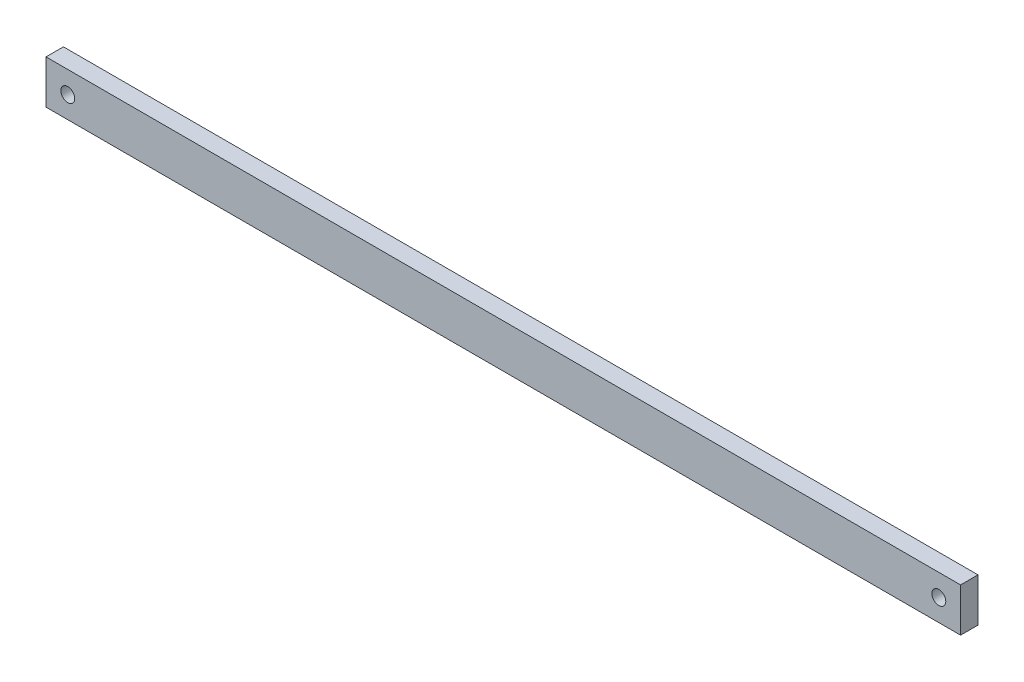
ISO-10303-21;
HEADER;
FILE_DESCRIPTION(('STEP AP214'),'2;1');
FILE_NAME('part.step','',(''),(''),'','','');
FILE_SCHEMA(('AUTOMOTIVE_DESIGN { 1 0 10303 214 1 1 1 1 }'));
ENDSEC;
DATA;
#1=APPLICATION_CONTEXT('core data for automotive mechanical design processes');
#2=APPLICATION_PROTOCOL_DEFINITION('international standard','automotive_design',2000,#1);
#3=PRODUCT_CONTEXT('',#1,'mechanical');
#4=PRODUCT('Part','Part','',(#3));
#5=PRODUCT_RELATED_PRODUCT_CATEGORY('part','',(#4));
#6=PRODUCT_DEFINITION_FORMATION('','',#4);
#7=PRODUCT_DEFINITION_CONTEXT('part definition',#1,'design');
#8=PRODUCT_DEFINITION('design','',#6,#7);
#9=PRODUCT_DEFINITION_SHAPE('','',#8);
#10=(LENGTH_UNIT() NAMED_UNIT(*) SI_UNIT(.MILLI.,.METRE.));
#11=(NAMED_UNIT(*) PLANE_ANGLE_UNIT() SI_UNIT($,.RADIAN.));
#12=(NAMED_UNIT(*) SI_UNIT($,.STERADIAN.) SOLID_ANGLE_UNIT());
#13=UNCERTAINTY_MEASURE_WITH_UNIT(LENGTH_MEASURE(1.E-05),#10,'distance_accuracy_value','');
#14=(GEOMETRIC_REPRESENTATION_CONTEXT(3) GLOBAL_UNCERTAINTY_ASSIGNED_CONTEXT((#13)) GLOBAL_UNIT_ASSIGNED_CONTEXT((#10,
#11,#12)) REPRESENTATION_CONTEXT('',''));
#15=CARTESIAN_POINT('',(0.,0.,0.));
#16=DIRECTION('',(0.,0.,1.));
#17=DIRECTION('',(1.,0.,0.));
#18=AXIS2_PLACEMENT_3D('',#15,#16,#17);
#19=CARTESIAN_POINT('',(0.,0.,4.));
#20=DIRECTION('',(0.,0.,1.));
#21=DIRECTION('',(1.,0.,0.));
#22=AXIS2_PLACEMENT_3D('',#19,#20,#21);
#23=PLANE('',#22);
#24=CARTESIAN_POINT('',(-100.,0.,4.));
#25=DIRECTION('',(0.,0.,1.));
#26=DIRECTION('',(1.,0.,0.));
#27=AXIS2_PLACEMENT_3D('',#24,#25,#26);
#28=CIRCLE('',#27,1.60000000000001);
#29=CARTESIAN_POINT('',(-98.4,0.,4.));
#30=VERTEX_POINT('',#29);
#31=EDGE_CURVE('E116',#30,#30,#28,.T.);
#32=ORIENTED_EDGE('',*,*,#31,.F.);
#33=EDGE_LOOP('',(#32));
#34=FACE_BOUND('',#33,.T.);
#35=DIRECTION('',(0.,-1.,0.));
#36=VECTOR('',#35,1.);
#37=CARTESIAN_POINT('',(-105.,-5.00000000000001,4.));
#38=LINE('',#37,#36);
#39=CARTESIAN_POINT('',(-105.,4.99999999999999,4.));
#40=VERTEX_POINT('',#39);
#41=CARTESIAN_POINT('',(-105.,-5.00000000000001,4.));
#42=VERTEX_POINT('',#41);
#43=EDGE_CURVE('E96',#40,#42,#38,.T.);
#44=ORIENTED_EDGE('',*,*,#43,.T.);
#45=DIRECTION('',(1.,0.,0.));
#46=VECTOR('',#45,1.);
#47=CARTESIAN_POINT('',(105.,-4.99999999999999,4.));
#48=LINE('',#47,#46);
#49=CARTESIAN_POINT('',(105.,-4.99999999999999,4.));
#50=VERTEX_POINT('',#49);
#51=EDGE_CURVE('E91',#42,#50,#48,.T.);
#52=ORIENTED_EDGE('',*,*,#51,.T.);
#53=DIRECTION('',(0.,1.,0.));
#54=VECTOR('',#53,1.);
#55=CARTESIAN_POINT('',(105.,-4.99999999999999,4.));
#56=LINE('',#55,#54);
#57=CARTESIAN_POINT('',(105.,5.00000000000001,4.));
#58=VERTEX_POINT('',#57);
#59=EDGE_CURVE('E94',#50,#58,#56,.T.);
#60=ORIENTED_EDGE('',*,*,#59,.T.);
#61=DIRECTION('',(-1.,0.,0.));
#62=VECTOR('',#61,1.);
#63=CARTESIAN_POINT('',(105.,5.00000000000001,4.));
#64=LINE('',#63,#62);
#65=EDGE_CURVE('E61',#58,#40,#64,.T.);
#66=ORIENTED_EDGE('',*,*,#65,.T.);
#67=EDGE_LOOP('',(#44,#52,#60,#66));
#68=FACE_BOUND('',#67,.T.);
#69=CARTESIAN_POINT('',(100.,0.,4.));
#70=DIRECTION('',(0.,0.,1.));
#71=DIRECTION('',(-1.,0.,0.));
#72=AXIS2_PLACEMENT_3D('',#69,#70,#71);
#73=CIRCLE('',#72,1.60000000000001);
#74=CARTESIAN_POINT('',(98.4000000000001,0.,4.));
#75=VERTEX_POINT('',#74);
#76=EDGE_CURVE('E138',#75,#75,#73,.T.);
#77=ORIENTED_EDGE('',*,*,#76,.F.);
#78=EDGE_LOOP('',(#77));
#79=FACE_BOUND('',#78,.T.);
#80=ADVANCED_FACE('F43',(#34,#68,#79),#23,.T.);
#81=CARTESIAN_POINT('',(0.,0.,0.));
#82=DIRECTION('',(0.,0.,1.));
#83=DIRECTION('',(1.,0.,0.));
#84=AXIS2_PLACEMENT_3D('',#81,#82,#83);
#85=PLANE('',#84);
#86=DIRECTION('',(0.,-1.,0.));
#87=VECTOR('',#86,1.);
#88=CARTESIAN_POINT('',(-105.,-5.00000000000001,0.));
#89=LINE('',#88,#87);
#90=CARTESIAN_POINT('',(-105.,4.99999999999999,0.));
#91=VERTEX_POINT('',#90);
#92=CARTESIAN_POINT('',(-105.,-5.00000000000001,0.));
#93=VERTEX_POINT('',#92);
#94=EDGE_CURVE('E112',#91,#93,#89,.T.);
#95=ORIENTED_EDGE('',*,*,#94,.F.);
#96=DIRECTION('',(-1.,0.,0.));
#97=VECTOR('',#96,1.);
#98=CARTESIAN_POINT('',(105.,5.00000000000001,0.));
#99=LINE('',#98,#97);
#100=CARTESIAN_POINT('',(105.,5.00000000000001,0.));
#101=VERTEX_POINT('',#100);
#102=EDGE_CURVE('E84',#101,#91,#99,.T.);
#103=ORIENTED_EDGE('',*,*,#102,.F.);
#104=DIRECTION('',(0.,1.,0.));
#105=VECTOR('',#104,1.);
#106=CARTESIAN_POINT('',(105.,-4.99999999999999,0.));
#107=LINE('',#106,#105);
#108=CARTESIAN_POINT('',(105.,-4.99999999999999,0.));
#109=VERTEX_POINT('',#108);
#110=EDGE_CURVE('E78',#109,#101,#107,.T.);
#111=ORIENTED_EDGE('',*,*,#110,.F.);
#112=DIRECTION('',(1.,0.,0.));
#113=VECTOR('',#112,1.);
#114=CARTESIAN_POINT('',(105.,-4.99999999999999,0.));
#115=LINE('',#114,#113);
#116=EDGE_CURVE('E101',#93,#109,#115,.T.);
#117=ORIENTED_EDGE('',*,*,#116,.F.);
#118=EDGE_LOOP('',(#95,#103,#111,#117));
#119=FACE_BOUND('',#118,.T.);
#120=CARTESIAN_POINT('',(-100.,0.,0.));
#121=DIRECTION('',(0.,0.,1.));
#122=DIRECTION('',(1.,0.,0.));
#123=AXIS2_PLACEMENT_3D('',#120,#121,#122);
#124=CIRCLE('',#123,1.60000000000001);
#125=CARTESIAN_POINT('',(-98.4,0.,0.));
#126=VERTEX_POINT('',#125);
#127=EDGE_CURVE('E134',#126,#126,#124,.T.);
#128=ORIENTED_EDGE('',*,*,#127,.T.);
#129=EDGE_LOOP('',(#128));
#130=FACE_BOUND('',#129,.T.);
#131=CARTESIAN_POINT('',(100.,0.,0.));
#132=DIRECTION('',(0.,0.,1.));
#133=DIRECTION('',(-1.,0.,0.));
#134=AXIS2_PLACEMENT_3D('',#131,#132,#133);
#135=CIRCLE('',#134,1.60000000000001);
#136=CARTESIAN_POINT('',(98.4000000000001,0.,0.));
#137=VERTEX_POINT('',#136);
#138=EDGE_CURVE('E142',#137,#137,#135,.T.);
#139=ORIENTED_EDGE('',*,*,#138,.T.);
#140=EDGE_LOOP('',(#139));
#141=FACE_BOUND('',#140,.T.);
#142=ADVANCED_FACE('F129',(#119,#130,#141),#85,.F.);
#143=CARTESIAN_POINT('',(-105.,-5.00000000000001,4.));
#144=DIRECTION('',(1.,0.,0.));
#145=DIRECTION('',(0.,0.,-1.));
#146=AXIS2_PLACEMENT_3D('',#143,#144,#145);
#147=PLANE('',#146);
#148=ORIENTED_EDGE('',*,*,#94,.T.);
#149=DIRECTION('',(0.,0.,-1.));
#150=VECTOR('',#149,1.);
#151=CARTESIAN_POINT('',(-105.,-5.00000000000001,4.));
#152=LINE('',#151,#150);
#153=EDGE_CURVE('E11',#42,#93,#152,.T.);
#154=ORIENTED_EDGE('',*,*,#153,.F.);
#155=ORIENTED_EDGE('',*,*,#43,.F.);
#156=DIRECTION('',(0.,0.,-1.));
#157=VECTOR('',#156,1.);
#158=CARTESIAN_POINT('',(-105.,4.99999999999999,4.));
#159=LINE('',#158,#157);
#160=EDGE_CURVE('E108',#40,#91,#159,.T.);
#161=ORIENTED_EDGE('',*,*,#160,.T.);
#162=EDGE_LOOP('',(#148,#154,#155,#161));
#163=FACE_BOUND('',#162,.T.);
#164=ADVANCED_FACE('F45',(#163),#147,.F.);
#165=CARTESIAN_POINT('',(105.,-4.99999999999999,4.));
#166=DIRECTION('',(0.,1.,0.));
#167=DIRECTION('',(-1.,0.,0.));
#168=AXIS2_PLACEMENT_3D('',#165,#166,#167);
#169=PLANE('',#168);
#170=ORIENTED_EDGE('',*,*,#116,.T.);
#171=DIRECTION('',(0.,0.,-1.));
#172=VECTOR('',#171,1.);
#173=CARTESIAN_POINT('',(105.,-4.99999999999999,4.));
#174=LINE('',#173,#172);
#175=EDGE_CURVE('E53',#50,#109,#174,.T.);
#176=ORIENTED_EDGE('',*,*,#175,.F.);
#177=ORIENTED_EDGE('',*,*,#51,.F.);
#178=ORIENTED_EDGE('',*,*,#153,.T.);
#179=EDGE_LOOP('',(#170,#176,#177,#178));
#180=FACE_BOUND('',#179,.T.);
#181=ADVANCED_FACE('F100',(#180),#169,.F.);
#182=CARTESIAN_POINT('',(105.,-4.99999999999999,4.));
#183=DIRECTION('',(-1.,0.,0.));
#184=DIRECTION('',(0.,-1.,0.));
#185=AXIS2_PLACEMENT_3D('',#182,#183,#184);
#186=PLANE('',#185);
#187=ORIENTED_EDGE('',*,*,#110,.T.);
#188=DIRECTION('',(0.,0.,-1.));
#189=VECTOR('',#188,1.);
#190=CARTESIAN_POINT('',(105.,5.00000000000001,4.));
#191=LINE('',#190,#189);
#192=EDGE_CURVE('E103',#58,#101,#191,.T.);
#193=ORIENTED_EDGE('',*,*,#192,.F.);
#194=ORIENTED_EDGE('',*,*,#59,.F.);
#195=ORIENTED_EDGE('',*,*,#175,.T.);
#196=EDGE_LOOP('',(#187,#193,#194,#195));
#197=FACE_BOUND('',#196,.T.);
#198=ADVANCED_FACE('F104',(#197),#186,.F.);
#199=CARTESIAN_POINT('',(105.,5.00000000000001,4.));
#200=DIRECTION('',(0.,-1.,0.));
#201=DIRECTION('',(1.,0.,0.));
#202=AXIS2_PLACEMENT_3D('',#199,#200,#201);
#203=PLANE('',#202);
#204=ORIENTED_EDGE('',*,*,#102,.T.);
#205=ORIENTED_EDGE('',*,*,#160,.F.);
#206=ORIENTED_EDGE('',*,*,#65,.F.);
#207=ORIENTED_EDGE('',*,*,#192,.T.);
#208=EDGE_LOOP('',(#204,#205,#206,#207));
#209=FACE_BOUND('',#208,.T.);
#210=ADVANCED_FACE('F126',(#209),#203,.F.);
#211=CARTESIAN_POINT('',(-100.,0.,4.));
#212=DIRECTION('',(0.,0.,-1.));
#213=DIRECTION('',(-1.,0.,0.));
#214=AXIS2_PLACEMENT_3D('',#211,#212,#213);
#215=CYLINDRICAL_SURFACE('',#214,1.60000000000001);
#216=ORIENTED_EDGE('',*,*,#31,.T.);
#217=EDGE_LOOP('',(#216));
#218=FACE_BOUND('',#217,.T.);
#219=ORIENTED_EDGE('',*,*,#127,.F.);
#220=EDGE_LOOP('',(#219));
#221=FACE_BOUND('',#220,.T.);
#222=ADVANCED_FACE('F161',(#218,#221),#215,.F.);
#223=CARTESIAN_POINT('',(100.,0.,4.));
#224=DIRECTION('',(0.,0.,-1.));
#225=DIRECTION('',(-1.,0.,0.));
#226=AXIS2_PLACEMENT_3D('',#223,#224,#225);
#227=CYLINDRICAL_SURFACE('',#226,1.60000000000001);
#228=ORIENTED_EDGE('',*,*,#76,.T.);
#229=EDGE_LOOP('',(#228));
#230=FACE_BOUND('',#229,.T.);
#231=ORIENTED_EDGE('',*,*,#138,.F.);
#232=EDGE_LOOP('',(#231));
#233=FACE_BOUND('',#232,.T.);
#234=ADVANCED_FACE('F150',(#230,#233),#227,.F.);
#235=CLOSED_SHELL('',(#80,#142,#164,#181,#198,#210,#222,#234));
#236=MANIFOLD_SOLID_BREP('B2',#235);
#237=ADVANCED_BREP_SHAPE_REPRESENTATION('',(#18,#236),#14);
#238=SHAPE_DEFINITION_REPRESENTATION(#9,#237);
ENDSEC;
END-ISO-10303-21;
